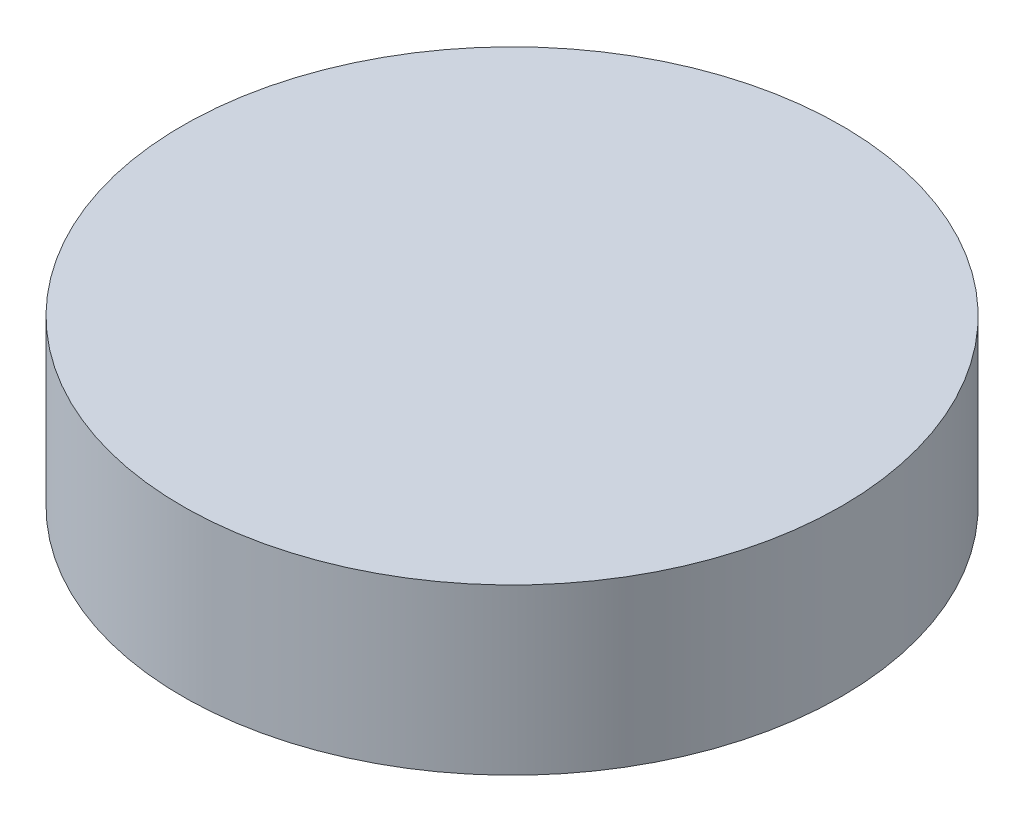
ISO-10303-21;
HEADER;
FILE_DESCRIPTION(('STEP AP214'),'2;1');
FILE_NAME('part.step','',(''),(''),'','','');
FILE_SCHEMA(('AUTOMOTIVE_DESIGN { 1 0 10303 214 1 1 1 1 }'));
ENDSEC;
DATA;
#1=APPLICATION_CONTEXT('core data for automotive mechanical design processes');
#2=APPLICATION_PROTOCOL_DEFINITION('international standard','automotive_design',2000,#1);
#3=PRODUCT_CONTEXT('',#1,'mechanical');
#4=PRODUCT('Part','Part','',(#3));
#5=PRODUCT_RELATED_PRODUCT_CATEGORY('part','',(#4));
#6=PRODUCT_DEFINITION_FORMATION('','',#4);
#7=PRODUCT_DEFINITION_CONTEXT('part definition',#1,'design');
#8=PRODUCT_DEFINITION('design','',#6,#7);
#9=PRODUCT_DEFINITION_SHAPE('','',#8);
#10=(LENGTH_UNIT() NAMED_UNIT(*) SI_UNIT(.MILLI.,.METRE.));
#11=(NAMED_UNIT(*) PLANE_ANGLE_UNIT() SI_UNIT($,.RADIAN.));
#12=(NAMED_UNIT(*) SI_UNIT($,.STERADIAN.) SOLID_ANGLE_UNIT());
#13=UNCERTAINTY_MEASURE_WITH_UNIT(LENGTH_MEASURE(1.E-05),#10,'distance_accuracy_value','');
#14=(GEOMETRIC_REPRESENTATION_CONTEXT(3) GLOBAL_UNCERTAINTY_ASSIGNED_CONTEXT((#13)) GLOBAL_UNIT_ASSIGNED_CONTEXT((#10,
#11,#12)) REPRESENTATION_CONTEXT('',''));
#15=CARTESIAN_POINT('',(0.,0.,0.));
#16=DIRECTION('',(0.,0.,1.));
#17=DIRECTION('',(1.,0.,0.));
#18=AXIS2_PLACEMENT_3D('',#15,#16,#17);
#19=CARTESIAN_POINT('',(0.,5.2,0.));
#20=DIRECTION('',(0.,-1.,0.));
#21=DIRECTION('',(1.,0.,0.));
#22=AXIS2_PLACEMENT_3D('',#19,#20,#21);
#23=CYLINDRICAL_SURFACE('',#22,12.);
#24=CARTESIAN_POINT('',(0.,0.,0.));
#25=DIRECTION('',(0.,-1.,0.));
#26=DIRECTION('',(1.,0.,0.));
#27=AXIS2_PLACEMENT_3D('',#24,#25,#26);
#28=CIRCLE('',#27,12.);
#29=CARTESIAN_POINT('',(12.,0.,0.));
#30=VERTEX_POINT('',#29);
#31=EDGE_CURVE('E10',#30,#30,#28,.T.);
#32=ORIENTED_EDGE('',*,*,#31,.F.);
#33=EDGE_LOOP('',(#32));
#34=FACE_BOUND('',#33,.T.);
#35=CARTESIAN_POINT('',(0.,6.,0.));
#36=DIRECTION('',(0.,-1.,0.));
#37=DIRECTION('',(1.,0.,0.));
#38=AXIS2_PLACEMENT_3D('',#35,#36,#37);
#39=CIRCLE('',#38,12.);
#40=CARTESIAN_POINT('',(12.,6.,0.));
#41=VERTEX_POINT('',#40);
#42=EDGE_CURVE('E43',#41,#41,#39,.T.);
#43=ORIENTED_EDGE('',*,*,#42,.T.);
#44=EDGE_LOOP('',(#43));
#45=FACE_BOUND('',#44,.T.);
#46=ADVANCED_FACE('F33',(#34,#45),#23,.T.);
#47=CARTESIAN_POINT('',(-3.81575680566778,0.,0.));
#48=DIRECTION('',(0.,1.,0.));
#49=DIRECTION('',(-1.,0.,0.));
#50=AXIS2_PLACEMENT_3D('',#47,#48,#49);
#51=PLANE('',#50);
#52=CARTESIAN_POINT('',(0.,0.,0.));
#53=DIRECTION('',(0.,-1.,0.));
#54=DIRECTION('',(1.,0.,0.));
#55=AXIS2_PLACEMENT_3D('',#52,#53,#54);
#56=CIRCLE('',#55,3.81575680566778);
#57=CARTESIAN_POINT('',(3.81575680566778,0.,0.));
#58=VERTEX_POINT('',#57);
#59=EDGE_CURVE('E39',#58,#58,#56,.T.);
#60=ORIENTED_EDGE('',*,*,#59,.F.);
#61=EDGE_LOOP('',(#60));
#62=FACE_BOUND('',#61,.T.);
#63=ORIENTED_EDGE('',*,*,#31,.T.);
#64=EDGE_LOOP('',(#63));
#65=FACE_BOUND('',#64,.T.);
#66=ADVANCED_FACE('F58',(#62,#65),#51,.F.);
#67=CARTESIAN_POINT('',(0.,1.2,0.));
#68=DIRECTION('',(0.,-1.,0.));
#69=DIRECTION('',(-1.,0.,0.));
#70=AXIS2_PLACEMENT_3D('',#67,#68,#69);
#71=SPHERICAL_SURFACE('',#70,4.);
#72=ORIENTED_EDGE('',*,*,#59,.T.);
#73=EDGE_LOOP('',(#72));
#74=FACE_BOUND('',#73,.T.);
#75=ADVANCED_FACE('F53',(#74),#71,.F.);
#76=CARTESIAN_POINT('',(-12.,6.,0.));
#77=DIRECTION('',(0.,-1.,0.));
#78=DIRECTION('',(1.,0.,0.));
#79=AXIS2_PLACEMENT_3D('',#76,#77,#78);
#80=PLANE('',#79);
#81=ORIENTED_EDGE('',*,*,#42,.F.);
#82=EDGE_LOOP('',(#81));
#83=FACE_BOUND('',#82,.T.);
#84=ADVANCED_FACE('F51',(#83),#80,.F.);
#85=CLOSED_SHELL('',(#46,#66,#75,#84));
#86=MANIFOLD_SOLID_BREP('B2',#85);
#87=ADVANCED_BREP_SHAPE_REPRESENTATION('',(#18,#86),#14);
#88=SHAPE_DEFINITION_REPRESENTATION(#9,#87);
ENDSEC;
END-ISO-10303-21;
